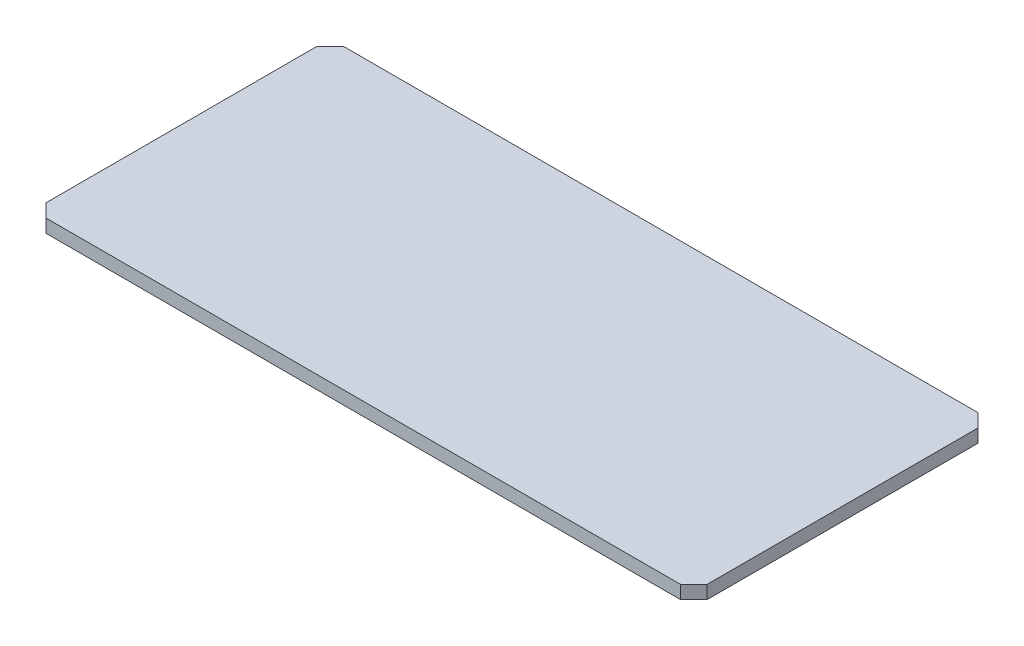
ISO-10303-21;
HEADER;
FILE_DESCRIPTION(('STEP AP214'),'2;1');
FILE_NAME('part.step','',(''),(''),'','','');
FILE_SCHEMA(('AUTOMOTIVE_DESIGN { 1 0 10303 214 1 1 1 1 }'));
ENDSEC;
DATA;
#1=APPLICATION_CONTEXT('core data for automotive mechanical design processes');
#2=APPLICATION_PROTOCOL_DEFINITION('international standard','automotive_design',2000,#1);
#3=PRODUCT_CONTEXT('',#1,'mechanical');
#4=PRODUCT('Part','Part','',(#3));
#5=PRODUCT_RELATED_PRODUCT_CATEGORY('part','',(#4));
#6=PRODUCT_DEFINITION_FORMATION('','',#4);
#7=PRODUCT_DEFINITION_CONTEXT('part definition',#1,'design');
#8=PRODUCT_DEFINITION('design','',#6,#7);
#9=PRODUCT_DEFINITION_SHAPE('','',#8);
#10=(LENGTH_UNIT() NAMED_UNIT(*) SI_UNIT(.MILLI.,.METRE.));
#11=(NAMED_UNIT(*) PLANE_ANGLE_UNIT() SI_UNIT($,.RADIAN.));
#12=(NAMED_UNIT(*) SI_UNIT($,.STERADIAN.) SOLID_ANGLE_UNIT());
#13=UNCERTAINTY_MEASURE_WITH_UNIT(LENGTH_MEASURE(1.E-05),#10,'distance_accuracy_value','');
#14=(GEOMETRIC_REPRESENTATION_CONTEXT(3) GLOBAL_UNCERTAINTY_ASSIGNED_CONTEXT((#13)) GLOBAL_UNIT_ASSIGNED_CONTEXT((#10,
#11,#12)) REPRESENTATION_CONTEXT('',''));
#15=CARTESIAN_POINT('',(0.,0.,0.));
#16=DIRECTION('',(0.,0.,1.));
#17=DIRECTION('',(1.,0.,0.));
#18=AXIS2_PLACEMENT_3D('',#15,#16,#17);
#19=CARTESIAN_POINT('',(0.,5.08,0.));
#20=DIRECTION('',(0.,1.,0.));
#21=DIRECTION('',(0.,0.,1.));
#22=AXIS2_PLACEMENT_3D('',#19,#20,#21);
#23=PLANE('',#22);
#24=DIRECTION('',(-1.,0.,0.));
#25=VECTOR('',#24,1.);
#26=CARTESIAN_POINT('',(0.,5.08,-114.3));
#27=LINE('',#26,#25);
#28=CARTESIAN_POINT('',(-5.08000000000003,5.08,-114.3));
#29=VERTEX_POINT('',#28);
#30=CARTESIAN_POINT('',(-248.92,5.08,-114.3));
#31=VERTEX_POINT('',#30);
#32=EDGE_CURVE('E182',#29,#31,#27,.T.);
#33=ORIENTED_EDGE('',*,*,#32,.T.);
#34=DIRECTION('',(0.707106781186548,0.,-0.707106781186548));
#35=VECTOR('',#34,1.);
#36=CARTESIAN_POINT('',(-181.61,5.08,-181.61));
#37=LINE('',#36,#35);
#38=CARTESIAN_POINT('',(-254.,5.08,-109.22));
#39=VERTEX_POINT('',#38);
#40=EDGE_CURVE('E160',#31,#39,#37,.F.);
#41=ORIENTED_EDGE('',*,*,#40,.T.);
#42=DIRECTION('',(0.,0.,1.));
#43=VECTOR('',#42,1.);
#44=CARTESIAN_POINT('',(-254.,5.08,0.));
#45=LINE('',#44,#43);
#46=CARTESIAN_POINT('',(-254.,5.08,-5.07999999999998));
#47=VERTEX_POINT('',#46);
#48=EDGE_CURVE('E131',#39,#47,#45,.T.);
#49=ORIENTED_EDGE('',*,*,#48,.T.);
#50=DIRECTION('',(-0.70710678118655,0.,-0.707106781186546));
#51=VECTOR('',#50,1.);
#52=CARTESIAN_POINT('',(-124.459999999999,5.08,124.46));
#53=LINE('',#52,#51);
#54=CARTESIAN_POINT('',(-248.92,5.08,0.));
#55=VERTEX_POINT('',#54);
#56=EDGE_CURVE('E67',#47,#55,#53,.F.);
#57=ORIENTED_EDGE('',*,*,#56,.T.);
#58=DIRECTION('',(1.,0.,0.));
#59=VECTOR('',#58,1.);
#60=CARTESIAN_POINT('',(0.,5.08,0.));
#61=LINE('',#60,#59);
#62=CARTESIAN_POINT('',(-5.08000000000003,5.08,0.));
#63=VERTEX_POINT('',#62);
#64=EDGE_CURVE('E146',#55,#63,#61,.T.);
#65=ORIENTED_EDGE('',*,*,#64,.T.);
#66=DIRECTION('',(-0.707106781186548,0.,0.707106781186548));
#67=VECTOR('',#66,1.);
#68=CARTESIAN_POINT('',(-2.54000000000001,5.08,-2.54000000000001));
#69=LINE('',#68,#67);
#70=CARTESIAN_POINT('',(0.,5.08,-5.08000000000003));
#71=VERTEX_POINT('',#70);
#72=EDGE_CURVE('E156',#63,#71,#69,.F.);
#73=ORIENTED_EDGE('',*,*,#72,.T.);
#74=DIRECTION('',(0.,0.,-1.));
#75=VECTOR('',#74,1.);
#76=CARTESIAN_POINT('',(0.,5.08,0.));
#77=LINE('',#76,#75);
#78=CARTESIAN_POINT('',(0.,5.08,-109.22));
#79=VERTEX_POINT('',#78);
#80=EDGE_CURVE('E140',#71,#79,#77,.T.);
#81=ORIENTED_EDGE('',*,*,#80,.T.);
#82=DIRECTION('',(0.707106781186548,0.,0.707106781186548));
#83=VECTOR('',#82,1.);
#84=CARTESIAN_POINT('',(54.61,5.08,-54.61));
#85=LINE('',#84,#83);
#86=EDGE_CURVE('E158',#79,#29,#85,.F.);
#87=ORIENTED_EDGE('',*,*,#86,.T.);
#88=EDGE_LOOP('',(#33,#41,#49,#57,#65,#73,#81,#87));
#89=FACE_BOUND('',#88,.T.);
#90=ADVANCED_FACE('F46',(#89),#23,.T.);
#91=CARTESIAN_POINT('',(0.,5.08,0.));
#92=DIRECTION('',(-1.,0.,0.));
#93=DIRECTION('',(0.,0.,1.));
#94=AXIS2_PLACEMENT_3D('',#91,#92,#93);
#95=PLANE('',#94);
#96=DIRECTION('',(0.,0.,-1.));
#97=VECTOR('',#96,1.);
#98=CARTESIAN_POINT('',(0.,0.,0.));
#99=LINE('',#98,#97);
#100=CARTESIAN_POINT('',(0.,0.,-5.08000000000003));
#101=VERTEX_POINT('',#100);
#102=CARTESIAN_POINT('',(0.,0.,-109.22));
#103=VERTEX_POINT('',#102);
#104=EDGE_CURVE('E142',#101,#103,#99,.T.);
#105=ORIENTED_EDGE('',*,*,#104,.T.);
#106=DIRECTION('',(0.,1.,0.));
#107=VECTOR('',#106,1.);
#108=CARTESIAN_POINT('',(0.,5.08,-109.22));
#109=LINE('',#108,#107);
#110=EDGE_CURVE('E165',#103,#79,#109,.T.);
#111=ORIENTED_EDGE('',*,*,#110,.T.);
#112=ORIENTED_EDGE('',*,*,#80,.F.);
#113=DIRECTION('',(0.,-1.,0.));
#114=VECTOR('',#113,1.);
#115=CARTESIAN_POINT('',(0.,5.08,-5.08000000000003));
#116=LINE('',#115,#114);
#117=EDGE_CURVE('E162',#71,#101,#116,.T.);
#118=ORIENTED_EDGE('',*,*,#117,.T.);
#119=EDGE_LOOP('',(#105,#111,#112,#118));
#120=FACE_BOUND('',#119,.T.);
#121=ADVANCED_FACE('F178',(#120),#95,.F.);
#122=CARTESIAN_POINT('',(0.,5.08,-114.3));
#123=DIRECTION('',(0.,0.,1.));
#124=DIRECTION('',(1.,0.,0.));
#125=AXIS2_PLACEMENT_3D('',#122,#123,#124);
#126=PLANE('',#125);
#127=DIRECTION('',(-1.,0.,0.));
#128=VECTOR('',#127,1.);
#129=CARTESIAN_POINT('',(0.,0.,-114.3));
#130=LINE('',#129,#128);
#131=CARTESIAN_POINT('',(-5.08000000000003,0.,-114.3));
#132=VERTEX_POINT('',#131);
#133=CARTESIAN_POINT('',(-248.92,0.,-114.3));
#134=VERTEX_POINT('',#133);
#135=EDGE_CURVE('E138',#132,#134,#130,.T.);
#136=ORIENTED_EDGE('',*,*,#135,.T.);
#137=DIRECTION('',(0.,1.,0.));
#138=VECTOR('',#137,1.);
#139=CARTESIAN_POINT('',(-248.92,5.08,-114.3));
#140=LINE('',#139,#138);
#141=EDGE_CURVE('E117',#134,#31,#140,.T.);
#142=ORIENTED_EDGE('',*,*,#141,.T.);
#143=ORIENTED_EDGE('',*,*,#32,.F.);
#144=DIRECTION('',(0.,-1.,0.));
#145=VECTOR('',#144,1.);
#146=CARTESIAN_POINT('',(-5.08000000000003,5.08,-114.3));
#147=LINE('',#146,#145);
#148=EDGE_CURVE('E122',#29,#132,#147,.T.);
#149=ORIENTED_EDGE('',*,*,#148,.T.);
#150=EDGE_LOOP('',(#136,#142,#143,#149));
#151=FACE_BOUND('',#150,.T.);
#152=ADVANCED_FACE('F195',(#151),#126,.F.);
#153=CARTESIAN_POINT('',(-254.,5.08,0.));
#154=DIRECTION('',(1.,0.,0.));
#155=DIRECTION('',(0.,0.,-1.));
#156=AXIS2_PLACEMENT_3D('',#153,#154,#155);
#157=PLANE('',#156);
#158=ORIENTED_EDGE('',*,*,#48,.F.);
#159=DIRECTION('',(0.,-1.,0.));
#160=VECTOR('',#159,1.);
#161=CARTESIAN_POINT('',(-254.,5.08,-109.22));
#162=LINE('',#161,#160);
#163=CARTESIAN_POINT('',(-254.,0.,-109.22));
#164=VERTEX_POINT('',#163);
#165=EDGE_CURVE('E116',#39,#164,#162,.T.);
#166=ORIENTED_EDGE('',*,*,#165,.T.);
#167=DIRECTION('',(0.,0.,1.));
#168=VECTOR('',#167,1.);
#169=CARTESIAN_POINT('',(-254.,0.,0.));
#170=LINE('',#169,#168);
#171=CARTESIAN_POINT('',(-254.,0.,-5.07999999999998));
#172=VERTEX_POINT('',#171);
#173=EDGE_CURVE('E129',#164,#172,#170,.T.);
#174=ORIENTED_EDGE('',*,*,#173,.T.);
#175=DIRECTION('',(0.,1.,0.));
#176=VECTOR('',#175,1.);
#177=CARTESIAN_POINT('',(-254.,5.08,-5.07999999999998));
#178=LINE('',#177,#176);
#179=EDGE_CURVE('E133',#172,#47,#178,.T.);
#180=ORIENTED_EDGE('',*,*,#179,.T.);
#181=EDGE_LOOP('',(#158,#166,#174,#180));
#182=FACE_BOUND('',#181,.T.);
#183=ADVANCED_FACE('F128',(#182),#157,.F.);
#184=CARTESIAN_POINT('',(0.,5.08,0.));
#185=DIRECTION('',(0.,0.,-1.));
#186=DIRECTION('',(-1.,0.,0.));
#187=AXIS2_PLACEMENT_3D('',#184,#185,#186);
#188=PLANE('',#187);
#189=DIRECTION('',(1.,0.,0.));
#190=VECTOR('',#189,1.);
#191=CARTESIAN_POINT('',(0.,0.,0.));
#192=LINE('',#191,#190);
#193=CARTESIAN_POINT('',(-248.92,0.,0.));
#194=VERTEX_POINT('',#193);
#195=CARTESIAN_POINT('',(-5.08000000000003,0.,0.));
#196=VERTEX_POINT('',#195);
#197=EDGE_CURVE('E137',#194,#196,#192,.T.);
#198=ORIENTED_EDGE('',*,*,#197,.T.);
#199=DIRECTION('',(0.,1.,0.));
#200=VECTOR('',#199,1.);
#201=CARTESIAN_POINT('',(-5.08000000000003,5.08,0.));
#202=LINE('',#201,#200);
#203=EDGE_CURVE('E11',#196,#63,#202,.T.);
#204=ORIENTED_EDGE('',*,*,#203,.T.);
#205=ORIENTED_EDGE('',*,*,#64,.F.);
#206=DIRECTION('',(0.,-1.,0.));
#207=VECTOR('',#206,1.);
#208=CARTESIAN_POINT('',(-248.92,5.08,0.));
#209=LINE('',#208,#207);
#210=EDGE_CURVE('E55',#55,#194,#209,.T.);
#211=ORIENTED_EDGE('',*,*,#210,.T.);
#212=EDGE_LOOP('',(#198,#204,#205,#211));
#213=FACE_BOUND('',#212,.T.);
#214=ADVANCED_FACE('F168',(#213),#188,.F.);
#215=CARTESIAN_POINT('',(0.,0.,0.));
#216=DIRECTION('',(0.,1.,0.));
#217=DIRECTION('',(0.,0.,1.));
#218=AXIS2_PLACEMENT_3D('',#215,#216,#217);
#219=PLANE('',#218);
#220=ORIENTED_EDGE('',*,*,#173,.F.);
#221=DIRECTION('',(-0.707106781186548,0.,0.707106781186548));
#222=VECTOR('',#221,1.);
#223=CARTESIAN_POINT('',(-254.,0.,-109.22));
#224=LINE('',#223,#222);
#225=EDGE_CURVE('E112',#164,#134,#224,.F.);
#226=ORIENTED_EDGE('',*,*,#225,.T.);
#227=ORIENTED_EDGE('',*,*,#135,.F.);
#228=DIRECTION('',(-0.707106781186548,0.,-0.707106781186548));
#229=VECTOR('',#228,1.);
#230=CARTESIAN_POINT('',(-5.08000000000003,0.,-114.3));
#231=LINE('',#230,#229);
#232=EDGE_CURVE('E123',#132,#103,#231,.F.);
#233=ORIENTED_EDGE('',*,*,#232,.T.);
#234=ORIENTED_EDGE('',*,*,#104,.F.);
#235=DIRECTION('',(0.707106781186548,0.,-0.707106781186548));
#236=VECTOR('',#235,1.);
#237=CARTESIAN_POINT('',(0.,0.,-5.08000000000003));
#238=LINE('',#237,#236);
#239=EDGE_CURVE('E149',#101,#196,#238,.F.);
#240=ORIENTED_EDGE('',*,*,#239,.T.);
#241=ORIENTED_EDGE('',*,*,#197,.F.);
#242=DIRECTION('',(0.70710678118655,0.,0.707106781186546));
#243=VECTOR('',#242,1.);
#244=CARTESIAN_POINT('',(-248.92,0.,0.));
#245=LINE('',#244,#243);
#246=EDGE_CURVE('E132',#194,#172,#245,.F.);
#247=ORIENTED_EDGE('',*,*,#246,.T.);
#248=EDGE_LOOP('',(#220,#226,#227,#233,#234,#240,#241,#247));
#249=FACE_BOUND('',#248,.T.);
#250=ADVANCED_FACE('F135',(#249),#219,.F.);
#251=CARTESIAN_POINT('',(-254.,5.08,-109.22));
#252=DIRECTION('',(0.707106781186548,0.,0.707106781186548));
#253=DIRECTION('',(0.,-1.,0.));
#254=AXIS2_PLACEMENT_3D('',#251,#252,#253);
#255=PLANE('',#254);
#256=ORIENTED_EDGE('',*,*,#40,.F.);
#257=ORIENTED_EDGE('',*,*,#141,.F.);
#258=ORIENTED_EDGE('',*,*,#225,.F.);
#259=ORIENTED_EDGE('',*,*,#165,.F.);
#260=EDGE_LOOP('',(#256,#257,#258,#259));
#261=FACE_BOUND('',#260,.T.);
#262=ADVANCED_FACE('F115',(#261),#255,.F.);
#263=CARTESIAN_POINT('',(-5.08000000000003,5.08,-114.3));
#264=DIRECTION('',(-0.707106781186547,0.,0.707106781186547));
#265=DIRECTION('',(0.,-1.,0.));
#266=AXIS2_PLACEMENT_3D('',#263,#264,#265);
#267=PLANE('',#266);
#268=ORIENTED_EDGE('',*,*,#86,.F.);
#269=ORIENTED_EDGE('',*,*,#110,.F.);
#270=ORIENTED_EDGE('',*,*,#232,.F.);
#271=ORIENTED_EDGE('',*,*,#148,.F.);
#272=EDGE_LOOP('',(#268,#269,#270,#271));
#273=FACE_BOUND('',#272,.T.);
#274=ADVANCED_FACE('F213',(#273),#267,.F.);
#275=CARTESIAN_POINT('',(0.,5.08,-5.08000000000003));
#276=DIRECTION('',(-0.707106781186547,0.,-0.707106781186547));
#277=DIRECTION('',(0.,-1.,0.));
#278=AXIS2_PLACEMENT_3D('',#275,#276,#277);
#279=PLANE('',#278);
#280=ORIENTED_EDGE('',*,*,#72,.F.);
#281=ORIENTED_EDGE('',*,*,#203,.F.);
#282=ORIENTED_EDGE('',*,*,#239,.F.);
#283=ORIENTED_EDGE('',*,*,#117,.F.);
#284=EDGE_LOOP('',(#280,#281,#282,#283));
#285=FACE_BOUND('',#284,.T.);
#286=ADVANCED_FACE('F175',(#285),#279,.F.);
#287=CARTESIAN_POINT('',(-248.92,5.08,0.));
#288=DIRECTION('',(0.707106781186546,0.,-0.70710678118655));
#289=DIRECTION('',(0.,-1.,0.));
#290=AXIS2_PLACEMENT_3D('',#287,#288,#289);
#291=PLANE('',#290);
#292=ORIENTED_EDGE('',*,*,#56,.F.);
#293=ORIENTED_EDGE('',*,*,#179,.F.);
#294=ORIENTED_EDGE('',*,*,#246,.F.);
#295=ORIENTED_EDGE('',*,*,#210,.F.);
#296=EDGE_LOOP('',(#292,#293,#294,#295));
#297=FACE_BOUND('',#296,.T.);
#298=ADVANCED_FACE('F49',(#297),#291,.F.);
#299=CLOSED_SHELL('',(#90,#121,#152,#183,#214,#250,#262,#274,#286,#298));
#300=MANIFOLD_SOLID_BREP('B2',#299);
#301=ADVANCED_BREP_SHAPE_REPRESENTATION('',(#18,#300),#14);
#302=SHAPE_DEFINITION_REPRESENTATION(#9,#301);
ENDSEC;
END-ISO-10303-21;
